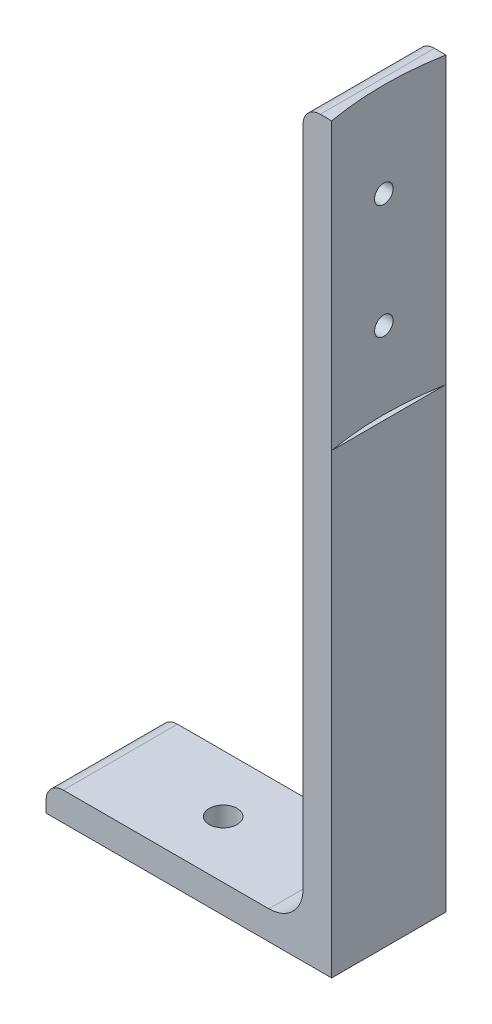
ISO-10303-21;
HEADER;
FILE_DESCRIPTION(('STEP AP214'),'2;1');
FILE_NAME('part.step','',(''),(''),'','','');
FILE_SCHEMA(('AUTOMOTIVE_DESIGN { 1 0 10303 214 1 1 1 1 }'));
ENDSEC;
DATA;
#1=APPLICATION_CONTEXT('core data for automotive mechanical design processes');
#2=APPLICATION_PROTOCOL_DEFINITION('international standard','automotive_design',2000,#1);
#3=PRODUCT_CONTEXT('',#1,'mechanical');
#4=PRODUCT('Part','Part','',(#3));
#5=PRODUCT_RELATED_PRODUCT_CATEGORY('part','',(#4));
#6=PRODUCT_DEFINITION_FORMATION('','',#4);
#7=PRODUCT_DEFINITION_CONTEXT('part definition',#1,'design');
#8=PRODUCT_DEFINITION('design','',#6,#7);
#9=PRODUCT_DEFINITION_SHAPE('','',#8);
#10=(LENGTH_UNIT() NAMED_UNIT(*) SI_UNIT(.MILLI.,.METRE.));
#11=(NAMED_UNIT(*) PLANE_ANGLE_UNIT() SI_UNIT($,.RADIAN.));
#12=(NAMED_UNIT(*) SI_UNIT($,.STERADIAN.) SOLID_ANGLE_UNIT());
#13=UNCERTAINTY_MEASURE_WITH_UNIT(LENGTH_MEASURE(1.E-05),#10,'distance_accuracy_value','');
#14=(GEOMETRIC_REPRESENTATION_CONTEXT(3) GLOBAL_UNCERTAINTY_ASSIGNED_CONTEXT((#13)) GLOBAL_UNIT_ASSIGNED_CONTEXT((#10,
#11,#12)) REPRESENTATION_CONTEXT('',''));
#15=CARTESIAN_POINT('',(0.,0.,0.));
#16=DIRECTION('',(0.,0.,1.));
#17=DIRECTION('',(1.,0.,0.));
#18=AXIS2_PLACEMENT_3D('',#15,#16,#17);
#19=CARTESIAN_POINT('',(0.,0.,10.));
#20=DIRECTION('',(-1.,0.,0.));
#21=DIRECTION('',(0.,0.,1.));
#22=AXIS2_PLACEMENT_3D('',#19,#20,#21);
#23=PLANE('',#22);
#24=DIRECTION('',(0.,0.,-1.));
#25=VECTOR('',#24,1.);
#26=CARTESIAN_POINT('',(0.,80.,0.));
#27=LINE('',#26,#25);
#28=CARTESIAN_POINT('',(0.,80.,10.));
#29=VERTEX_POINT('',#28);
#30=CARTESIAN_POINT('',(0.,80.,-10.));
#31=VERTEX_POINT('',#30);
#32=EDGE_CURVE('E277',#29,#31,#27,.T.);
#33=ORIENTED_EDGE('',*,*,#32,.F.);
#34=DIRECTION('',(0.,1.,0.));
#35=VECTOR('',#34,1.);
#36=CARTESIAN_POINT('',(0.,0.,10.));
#37=LINE('',#36,#35);
#38=CARTESIAN_POINT('',(0.,0.,10.));
#39=VERTEX_POINT('',#38);
#40=EDGE_CURVE('E151',#39,#29,#37,.T.);
#41=ORIENTED_EDGE('',*,*,#40,.F.);
#42=DIRECTION('',(0.,0.,-1.));
#43=VECTOR('',#42,1.);
#44=CARTESIAN_POINT('',(0.,0.,10.));
#45=LINE('',#44,#43);
#46=CARTESIAN_POINT('',(0.,0.,-10.));
#47=VERTEX_POINT('',#46);
#48=EDGE_CURVE('E146',#39,#47,#45,.T.);
#49=ORIENTED_EDGE('',*,*,#48,.T.);
#50=DIRECTION('',(0.,1.,0.));
#51=VECTOR('',#50,1.);
#52=CARTESIAN_POINT('',(0.,0.,-10.));
#53=LINE('',#52,#51);
#54=EDGE_CURVE('E173',#47,#31,#53,.T.);
#55=ORIENTED_EDGE('',*,*,#54,.T.);
#56=EDGE_LOOP('',(#33,#41,#49,#55));
#57=FACE_BOUND('',#56,.T.);
#58=ADVANCED_FACE('F36',(#57),#23,.F.);
#59=CARTESIAN_POINT('',(-2.,127.,10.));
#60=DIRECTION('',(0.,0.,-1.));
#61=DIRECTION('',(-1.,0.,0.));
#62=AXIS2_PLACEMENT_3D('',#59,#60,#61);
#63=CYLINDRICAL_SURFACE('',#62,3.);
#64=CARTESIAN_POINT('',(-2.,127.,-10.));
#65=DIRECTION('',(0.,0.,1.));
#66=DIRECTION('',(1.,0.,0.));
#67=AXIS2_PLACEMENT_3D('',#64,#65,#66);
#68=CIRCLE('',#67,3.);
#69=CARTESIAN_POINT('',(-2.,130.,-10.));
#70=VERTEX_POINT('',#69);
#71=CARTESIAN_POINT('',(-5.,127.,-10.));
#72=VERTEX_POINT('',#71);
#73=EDGE_CURVE('E158',#70,#72,#68,.T.);
#74=ORIENTED_EDGE('',*,*,#73,.T.);
#75=DIRECTION('',(0.,0.,-1.));
#76=VECTOR('',#75,1.);
#77=CARTESIAN_POINT('',(-5.,127.,10.));
#78=LINE('',#77,#76);
#79=CARTESIAN_POINT('',(-5.,127.,10.));
#80=VERTEX_POINT('',#79);
#81=EDGE_CURVE('E11',#80,#72,#78,.T.);
#82=ORIENTED_EDGE('',*,*,#81,.F.);
#83=CARTESIAN_POINT('',(-2.,127.,10.));
#84=DIRECTION('',(0.,0.,1.));
#85=DIRECTION('',(1.,0.,0.));
#86=AXIS2_PLACEMENT_3D('',#83,#84,#85);
#87=CIRCLE('',#86,3.);
#88=CARTESIAN_POINT('',(-2.,130.,10.));
#89=VERTEX_POINT('',#88);
#90=EDGE_CURVE('E177',#89,#80,#87,.T.);
#91=ORIENTED_EDGE('',*,*,#90,.F.);
#92=DIRECTION('',(0.,0.,-1.));
#93=VECTOR('',#92,1.);
#94=CARTESIAN_POINT('',(-2.,130.,10.));
#95=LINE('',#94,#93);
#96=EDGE_CURVE('E157',#89,#70,#95,.T.);
#97=ORIENTED_EDGE('',*,*,#96,.T.);
#98=EDGE_LOOP('',(#74,#82,#91,#97));
#99=FACE_BOUND('',#98,.T.);
#100=ADVANCED_FACE('F38',(#99),#63,.T.);
#101=CARTESIAN_POINT('',(-5.,127.,10.));
#102=DIRECTION('',(1.,0.,0.));
#103=DIRECTION('',(0.,1.,0.));
#104=AXIS2_PLACEMENT_3D('',#101,#102,#103);
#105=PLANE('',#104);
#106=CARTESIAN_POINT('',(-4.99999999999999,93.5,0.));
#107=DIRECTION('',(-1.,0.,0.));
#108=DIRECTION('',(0.,-1.,0.));
#109=AXIS2_PLACEMENT_3D('',#106,#107,#108);
#110=CIRCLE('',#109,1.625);
#111=CARTESIAN_POINT('',(-4.99999999999999,91.875,0.));
#112=VERTEX_POINT('',#111);
#113=EDGE_CURVE('E194',#112,#112,#110,.T.);
#114=ORIENTED_EDGE('',*,*,#113,.F.);
#115=EDGE_LOOP('',(#114));
#116=FACE_BOUND('',#115,.T.);
#117=CARTESIAN_POINT('',(-5.,113.5,0.));
#118=DIRECTION('',(-1.,0.,0.));
#119=DIRECTION('',(0.,-1.,0.));
#120=AXIS2_PLACEMENT_3D('',#117,#118,#119);
#121=CIRCLE('',#120,1.625);
#122=CARTESIAN_POINT('',(-5.,111.875,0.));
#123=VERTEX_POINT('',#122);
#124=EDGE_CURVE('E252',#123,#123,#121,.T.);
#125=ORIENTED_EDGE('',*,*,#124,.F.);
#126=EDGE_LOOP('',(#125));
#127=FACE_BOUND('',#126,.T.);
#128=DIRECTION('',(0.,-1.,0.));
#129=VECTOR('',#128,1.);
#130=CARTESIAN_POINT('',(-5.,127.,-10.));
#131=LINE('',#130,#129);
#132=CARTESIAN_POINT('',(-4.99999999999999,11.,-10.));
#133=VERTEX_POINT('',#132);
#134=EDGE_CURVE('E161',#72,#133,#131,.T.);
#135=ORIENTED_EDGE('',*,*,#134,.T.);
#136=DIRECTION('',(0.,0.,-1.));
#137=VECTOR('',#136,1.);
#138=CARTESIAN_POINT('',(-4.99999999999999,11.,10.));
#139=LINE('',#138,#137);
#140=CARTESIAN_POINT('',(-4.99999999999999,11.,10.));
#141=VERTEX_POINT('',#140);
#142=EDGE_CURVE('E50',#141,#133,#139,.T.);
#143=ORIENTED_EDGE('',*,*,#142,.F.);
#144=DIRECTION('',(0.,-1.,0.));
#145=VECTOR('',#144,1.);
#146=CARTESIAN_POINT('',(-5.,127.,10.));
#147=LINE('',#146,#145);
#148=EDGE_CURVE('E109',#80,#141,#147,.T.);
#149=ORIENTED_EDGE('',*,*,#148,.F.);
#150=ORIENTED_EDGE('',*,*,#81,.T.);
#151=EDGE_LOOP('',(#135,#143,#149,#150));
#152=FACE_BOUND('',#151,.T.);
#153=ADVANCED_FACE('F220',(#116,#127,#152),#105,.F.);
#154=CARTESIAN_POINT('',(-11.,11.,10.));
#155=DIRECTION('',(0.,0.,-1.));
#156=DIRECTION('',(-1.,0.,0.));
#157=AXIS2_PLACEMENT_3D('',#154,#155,#156);
#158=CYLINDRICAL_SURFACE('',#157,6.);
#159=CARTESIAN_POINT('',(-11.,11.,-10.));
#160=DIRECTION('',(0.,0.,-1.));
#161=DIRECTION('',(-1.,0.,0.));
#162=AXIS2_PLACEMENT_3D('',#159,#160,#161);
#163=CIRCLE('',#162,6.);
#164=CARTESIAN_POINT('',(-11.,5.,-10.));
#165=VERTEX_POINT('',#164);
#166=EDGE_CURVE('E164',#133,#165,#163,.T.);
#167=ORIENTED_EDGE('',*,*,#166,.T.);
#168=DIRECTION('',(0.,0.,-1.));
#169=VECTOR('',#168,1.);
#170=CARTESIAN_POINT('',(-11.,5.,10.));
#171=LINE('',#170,#169);
#172=CARTESIAN_POINT('',(-11.,5.,10.));
#173=VERTEX_POINT('',#172);
#174=EDGE_CURVE('E184',#173,#165,#171,.T.);
#175=ORIENTED_EDGE('',*,*,#174,.F.);
#176=CARTESIAN_POINT('',(-11.,11.,10.));
#177=DIRECTION('',(0.,0.,-1.));
#178=DIRECTION('',(-1.,0.,0.));
#179=AXIS2_PLACEMENT_3D('',#176,#177,#178);
#180=CIRCLE('',#179,6.);
#181=EDGE_CURVE('E259',#141,#173,#180,.T.);
#182=ORIENTED_EDGE('',*,*,#181,.F.);
#183=ORIENTED_EDGE('',*,*,#142,.T.);
#184=EDGE_LOOP('',(#167,#175,#182,#183));
#185=FACE_BOUND('',#184,.T.);
#186=ADVANCED_FACE('F239',(#185),#158,.F.);
#187=CARTESIAN_POINT('',(-11.,5.,10.));
#188=DIRECTION('',(0.,-1.,0.));
#189=DIRECTION('',(1.,0.,0.));
#190=AXIS2_PLACEMENT_3D('',#187,#188,#189);
#191=PLANE('',#190);
#192=CARTESIAN_POINT('',(-29.,5.,0.));
#193=DIRECTION('',(0.,1.,0.));
#194=DIRECTION('',(-1.,0.,0.));
#195=AXIS2_PLACEMENT_3D('',#192,#193,#194);
#196=CIRCLE('',#195,2.45);
#197=CARTESIAN_POINT('',(-31.45,5.,0.));
#198=VERTEX_POINT('',#197);
#199=EDGE_CURVE('E283',#198,#198,#196,.T.);
#200=ORIENTED_EDGE('',*,*,#199,.F.);
#201=EDGE_LOOP('',(#200));
#202=FACE_BOUND('',#201,.T.);
#203=DIRECTION('',(-1.,0.,0.));
#204=VECTOR('',#203,1.);
#205=CARTESIAN_POINT('',(-11.,5.,-10.));
#206=LINE('',#205,#204);
#207=CARTESIAN_POINT('',(-47.,5.,-10.));
#208=VERTEX_POINT('',#207);
#209=EDGE_CURVE('E166',#165,#208,#206,.T.);
#210=ORIENTED_EDGE('',*,*,#209,.T.);
#211=DIRECTION('',(0.,0.,-1.));
#212=VECTOR('',#211,1.);
#213=CARTESIAN_POINT('',(-47.,5.,10.));
#214=LINE('',#213,#212);
#215=CARTESIAN_POINT('',(-47.,5.,10.));
#216=VERTEX_POINT('',#215);
#217=EDGE_CURVE('E181',#216,#208,#214,.T.);
#218=ORIENTED_EDGE('',*,*,#217,.F.);
#219=DIRECTION('',(-1.,0.,0.));
#220=VECTOR('',#219,1.);
#221=CARTESIAN_POINT('',(-11.,5.,10.));
#222=LINE('',#221,#220);
#223=EDGE_CURVE('E265',#173,#216,#222,.T.);
#224=ORIENTED_EDGE('',*,*,#223,.F.);
#225=ORIENTED_EDGE('',*,*,#174,.T.);
#226=EDGE_LOOP('',(#210,#218,#224,#225));
#227=FACE_BOUND('',#226,.T.);
#228=ADVANCED_FACE('F235',(#202,#227),#191,.F.);
#229=CARTESIAN_POINT('',(-47.,1.99999999999999,10.));
#230=DIRECTION('',(0.,0.,-1.));
#231=DIRECTION('',(-1.,0.,0.));
#232=AXIS2_PLACEMENT_3D('',#229,#230,#231);
#233=CYLINDRICAL_SURFACE('',#232,3.);
#234=CARTESIAN_POINT('',(-47.,1.99999999999999,-10.));
#235=DIRECTION('',(0.,0.,1.));
#236=DIRECTION('',(1.,0.,0.));
#237=AXIS2_PLACEMENT_3D('',#234,#235,#236);
#238=CIRCLE('',#237,3.);
#239=CARTESIAN_POINT('',(-50.,1.99999999999999,-10.));
#240=VERTEX_POINT('',#239);
#241=EDGE_CURVE('E168',#208,#240,#238,.T.);
#242=ORIENTED_EDGE('',*,*,#241,.T.);
#243=DIRECTION('',(0.,0.,-1.));
#244=VECTOR('',#243,1.);
#245=CARTESIAN_POINT('',(-50.,1.99999999999999,10.));
#246=LINE('',#245,#244);
#247=CARTESIAN_POINT('',(-50.,1.99999999999999,10.));
#248=VERTEX_POINT('',#247);
#249=EDGE_CURVE('E145',#248,#240,#246,.T.);
#250=ORIENTED_EDGE('',*,*,#249,.F.);
#251=CARTESIAN_POINT('',(-47.,1.99999999999999,10.));
#252=DIRECTION('',(0.,0.,1.));
#253=DIRECTION('',(1.,0.,0.));
#254=AXIS2_PLACEMENT_3D('',#251,#252,#253);
#255=CIRCLE('',#254,3.);
#256=EDGE_CURVE('E133',#216,#248,#255,.T.);
#257=ORIENTED_EDGE('',*,*,#256,.F.);
#258=ORIENTED_EDGE('',*,*,#217,.T.);
#259=EDGE_LOOP('',(#242,#250,#257,#258));
#260=FACE_BOUND('',#259,.T.);
#261=ADVANCED_FACE('F232',(#260),#233,.T.);
#262=CARTESIAN_POINT('',(-50.,1.99999999999999,10.));
#263=DIRECTION('',(1.,0.,0.));
#264=DIRECTION('',(0.,0.,-1.));
#265=AXIS2_PLACEMENT_3D('',#262,#263,#264);
#266=PLANE('',#265);
#267=DIRECTION('',(0.,-1.,0.));
#268=VECTOR('',#267,1.);
#269=CARTESIAN_POINT('',(-50.,1.99999999999999,-10.));
#270=LINE('',#269,#268);
#271=CARTESIAN_POINT('',(-50.,0.,-10.));
#272=VERTEX_POINT('',#271);
#273=EDGE_CURVE('E142',#240,#272,#270,.T.);
#274=ORIENTED_EDGE('',*,*,#273,.T.);
#275=DIRECTION('',(0.,0.,-1.));
#276=VECTOR('',#275,1.);
#277=CARTESIAN_POINT('',(-50.,0.,10.));
#278=LINE('',#277,#276);
#279=CARTESIAN_POINT('',(-50.,0.,10.));
#280=VERTEX_POINT('',#279);
#281=EDGE_CURVE('E139',#280,#272,#278,.T.);
#282=ORIENTED_EDGE('',*,*,#281,.F.);
#283=DIRECTION('',(0.,-1.,0.));
#284=VECTOR('',#283,1.);
#285=CARTESIAN_POINT('',(-50.,1.99999999999999,10.));
#286=LINE('',#285,#284);
#287=EDGE_CURVE('E125',#248,#280,#286,.T.);
#288=ORIENTED_EDGE('',*,*,#287,.F.);
#289=ORIENTED_EDGE('',*,*,#249,.T.);
#290=EDGE_LOOP('',(#274,#282,#288,#289));
#291=FACE_BOUND('',#290,.T.);
#292=ADVANCED_FACE('F140',(#291),#266,.F.);
#293=CARTESIAN_POINT('',(0.,0.,10.));
#294=DIRECTION('',(0.,1.,0.));
#295=DIRECTION('',(-1.,0.,0.));
#296=AXIS2_PLACEMENT_3D('',#293,#294,#295);
#297=PLANE('',#296);
#298=CARTESIAN_POINT('',(-29.,0.,0.));
#299=DIRECTION('',(0.,1.,0.));
#300=DIRECTION('',(-1.,0.,0.));
#301=AXIS2_PLACEMENT_3D('',#298,#299,#300);
#302=CIRCLE('',#301,2.45);
#303=CARTESIAN_POINT('',(-31.45,0.,0.));
#304=VERTEX_POINT('',#303);
#305=EDGE_CURVE('E281',#304,#304,#302,.T.);
#306=ORIENTED_EDGE('',*,*,#305,.T.);
#307=EDGE_LOOP('',(#306));
#308=FACE_BOUND('',#307,.T.);
#309=DIRECTION('',(1.,0.,0.));
#310=VECTOR('',#309,1.);
#311=CARTESIAN_POINT('',(0.,0.,-10.));
#312=LINE('',#311,#310);
#313=EDGE_CURVE('E171',#272,#47,#312,.T.);
#314=ORIENTED_EDGE('',*,*,#313,.T.);
#315=ORIENTED_EDGE('',*,*,#48,.F.);
#316=DIRECTION('',(1.,0.,0.));
#317=VECTOR('',#316,1.);
#318=CARTESIAN_POINT('',(0.,0.,10.));
#319=LINE('',#318,#317);
#320=EDGE_CURVE('E130',#280,#39,#319,.T.);
#321=ORIENTED_EDGE('',*,*,#320,.F.);
#322=ORIENTED_EDGE('',*,*,#281,.T.);
#323=EDGE_LOOP('',(#314,#315,#321,#322));
#324=FACE_BOUND('',#323,.T.);
#325=ADVANCED_FACE('F148',(#308,#324),#297,.F.);
#326=CARTESIAN_POINT('',(-2.,130.,10.));
#327=DIRECTION('',(0.,-1.,0.));
#328=DIRECTION('',(0.,0.,-1.));
#329=AXIS2_PLACEMENT_3D('',#326,#327,#328);
#330=PLANE('',#329);
#331=DIRECTION('',(-1.,0.,0.));
#332=VECTOR('',#331,1.);
#333=CARTESIAN_POINT('',(-2.,130.,10.));
#334=LINE('',#333,#332);
#335=CARTESIAN_POINT('',(0.,130.,10.));
#336=VERTEX_POINT('',#335);
#337=EDGE_CURVE('E67',#336,#89,#334,.T.);
#338=ORIENTED_EDGE('',*,*,#337,.F.);
#339=CARTESIAN_POINT('',(56.1159513863928,130.,0.));
#340=DIRECTION('',(0.,1.,0.));
#341=DIRECTION('',(0.,0.,1.));
#342=AXIS2_PLACEMENT_3D('',#339,#340,#341);
#343=CIRCLE('',#342,57.);
#344=CARTESIAN_POINT('',(0.,130.,-10.));
#345=VERTEX_POINT('',#344);
#346=EDGE_CURVE('E274',#345,#336,#343,.T.);
#347=ORIENTED_EDGE('',*,*,#346,.F.);
#348=DIRECTION('',(-1.,0.,0.));
#349=VECTOR('',#348,1.);
#350=CARTESIAN_POINT('',(-2.,130.,-10.));
#351=LINE('',#350,#349);
#352=EDGE_CURVE('E101',#345,#70,#351,.T.);
#353=ORIENTED_EDGE('',*,*,#352,.T.);
#354=ORIENTED_EDGE('',*,*,#96,.F.);
#355=EDGE_LOOP('',(#338,#347,#353,#354));
#356=FACE_BOUND('',#355,.T.);
#357=ADVANCED_FACE('F225',(#356),#330,.F.);
#358=CARTESIAN_POINT('',(-2.,127.,10.));
#359=DIRECTION('',(0.,0.,1.));
#360=DIRECTION('',(1.,0.,0.));
#361=AXIS2_PLACEMENT_3D('',#358,#359,#360);
#362=PLANE('',#361);
#363=ORIENTED_EDGE('',*,*,#90,.T.);
#364=ORIENTED_EDGE('',*,*,#148,.T.);
#365=ORIENTED_EDGE('',*,*,#181,.T.);
#366=ORIENTED_EDGE('',*,*,#223,.T.);
#367=ORIENTED_EDGE('',*,*,#256,.T.);
#368=ORIENTED_EDGE('',*,*,#287,.T.);
#369=ORIENTED_EDGE('',*,*,#320,.T.);
#370=ORIENTED_EDGE('',*,*,#40,.T.);
#371=DIRECTION('',(0.,1.,0.));
#372=VECTOR('',#371,1.);
#373=CARTESIAN_POINT('',(0.,80.,10.));
#374=LINE('',#373,#372);
#375=EDGE_CURVE('E162',#29,#336,#374,.T.);
#376=ORIENTED_EDGE('',*,*,#375,.T.);
#377=ORIENTED_EDGE('',*,*,#337,.T.);
#378=EDGE_LOOP('',(#363,#364,#365,#366,#367,#368,#369,#370,#376,#377));
#379=FACE_BOUND('',#378,.T.);
#380=ADVANCED_FACE('F127',(#379),#362,.T.);
#381=CARTESIAN_POINT('',(-2.,127.,-10.));
#382=DIRECTION('',(0.,0.,1.));
#383=DIRECTION('',(1.,0.,0.));
#384=AXIS2_PLACEMENT_3D('',#381,#382,#383);
#385=PLANE('',#384);
#386=ORIENTED_EDGE('',*,*,#73,.F.);
#387=ORIENTED_EDGE('',*,*,#352,.F.);
#388=DIRECTION('',(0.,1.,0.));
#389=VECTOR('',#388,1.);
#390=CARTESIAN_POINT('',(0.,80.,-10.));
#391=LINE('',#390,#389);
#392=EDGE_CURVE('E271',#31,#345,#391,.T.);
#393=ORIENTED_EDGE('',*,*,#392,.F.);
#394=ORIENTED_EDGE('',*,*,#54,.F.);
#395=ORIENTED_EDGE('',*,*,#313,.F.);
#396=ORIENTED_EDGE('',*,*,#273,.F.);
#397=ORIENTED_EDGE('',*,*,#241,.F.);
#398=ORIENTED_EDGE('',*,*,#209,.F.);
#399=ORIENTED_EDGE('',*,*,#166,.F.);
#400=ORIENTED_EDGE('',*,*,#134,.F.);
#401=EDGE_LOOP('',(#386,#387,#393,#394,#395,#396,#397,#398,#399,#400));
#402=FACE_BOUND('',#401,.T.);
#403=ADVANCED_FACE('F212',(#402),#385,.F.);
#404=CARTESIAN_POINT('',(56.1159513863928,80.,0.));
#405=DIRECTION('',(0.,1.,0.));
#406=DIRECTION('',(0.,0.,1.));
#407=AXIS2_PLACEMENT_3D('',#404,#405,#406);
#408=CYLINDRICAL_SURFACE('',#407,57.);
#409=CARTESIAN_POINT('',(-0.884048613607205,91.875,0.));
#410=CARTESIAN_POINT('',(-0.884048301419244,91.8750040407851,0.0912570705500619));
#411=CARTESIAN_POINT('',(-0.883827108364941,91.8827130510623,0.182579839011391));
#412=CARTESIAN_POINT('',(-0.882965989506306,91.9133580817059,0.362708935005013));
#413=CARTESIAN_POINT('',(-0.88232556316476,91.93631230434,0.451512121922383));
#414=CARTESIAN_POINT('',(-0.880698506544359,91.9967925506374,0.623966457629173));
#415=CARTESIAN_POINT('',(-0.879712045260624,92.03431146221,0.707620097932997));
#416=CARTESIAN_POINT('',(-0.877504198818861,92.122845903173,0.867418236400548));
#417=CARTESIAN_POINT('',(-0.876282871132212,92.1738581319176,0.943564564708674));
#418=CARTESIAN_POINT('',(-0.873742237223969,92.2879567890859,1.08624244717693));
#419=CARTESIAN_POINT('',(-0.872422896051672,92.3510475373679,1.15277054640994));
#420=CARTESIAN_POINT('',(-0.869835242310035,92.487504940964,1.27429447354724));
#421=CARTESIAN_POINT('',(-0.868566931771846,92.5608720047822,1.32928984278529));
#422=CARTESIAN_POINT('',(-0.866224200511634,92.7158115271648,1.42619202997452));
#423=CARTESIAN_POINT('',(-0.865149809253497,92.7973852297096,1.46809685966885));
#424=CARTESIAN_POINT('',(-0.863316377658713,92.9664135646253,1.53761546507425));
#425=CARTESIAN_POINT('',(-0.862557336118333,93.0538681745465,1.56522929533611));
#426=CARTESIAN_POINT('',(-0.861440437415242,93.2321505052766,1.60537485451699));
#427=CARTESIAN_POINT('',(-0.861082470564122,93.3229772968164,1.61791070712445));
#428=CARTESIAN_POINT('',(-0.860807753271562,93.5054467623545,1.62755716307993));
#429=CARTESIAN_POINT('',(-0.860891001162523,93.5970894332678,1.62466782472849));
#430=CARTESIAN_POINT('',(-0.861489223482446,93.7785612792106,1.60354941438371));
#431=CARTESIAN_POINT('',(-0.86200407236305,93.8683909738356,1.5853248032602));
#432=CARTESIAN_POINT('',(-0.86340725970101,94.0437153684787,1.53406007525515));
#433=CARTESIAN_POINT('',(-0.864295598939145,94.1292100594341,1.50101992740184));
#434=CARTESIAN_POINT('',(-0.866345768980347,94.2934518908058,1.42105689833791));
#435=CARTESIAN_POINT('',(-0.867507640064752,94.3721980350735,1.37413197214041));
#436=CARTESIAN_POINT('',(-0.869973852324642,94.5206965142471,1.26773294211103));
#437=CARTESIAN_POINT('',(-0.871278193788508,94.5904488309476,1.20825881287757));
#438=CARTESIAN_POINT('',(-0.873882866099718,94.7190056338839,1.07842439122159));
#439=CARTESIAN_POINT('',(-0.875183195353381,94.7778062125266,1.0080602295557));
#440=CARTESIAN_POINT('',(-0.877632806960904,94.8827603125688,0.858456784977403));
#441=CARTESIAN_POINT('',(-0.878782089290813,94.9289138319628,0.779217500657651));
#442=CARTESIAN_POINT('',(-0.880800064456523,95.0072632328819,0.614110976005348));
#443=CARTESIAN_POINT('',(-0.88166875483895,95.0394589923672,0.528243677728453));
#444=CARTESIAN_POINT('',(-0.883027581099235,95.0889764559222,0.352319577175232));
#445=CARTESIAN_POINT('',(-0.883517717909278,95.106298196619,0.262262785216087));
#446=CARTESIAN_POINT('',(-0.884064066741103,95.1255711323636,0.0805500520662809));
#447=CARTESIAN_POINT('',(-0.884120431395588,95.1275277339938,-0.011105315249858));
#448=CARTESIAN_POINT('',(-0.883793286413652,95.1160289387422,-0.193443238277225));
#449=CARTESIAN_POINT('',(-0.88340977723559,95.1025735579202,-0.284125795002048));
#450=CARTESIAN_POINT('',(-0.882246206498614,95.0606372234982,-0.461928862868564));
#451=CARTESIAN_POINT('',(-0.881466209705213,95.0321587238681,-0.549049953258776));
#452=CARTESIAN_POINT('',(-0.879597562012541,94.9609870484448,-0.717274801962333));
#453=CARTESIAN_POINT('',(-0.878508910557204,94.9182938470427,-0.798378549434595));
#454=CARTESIAN_POINT('',(-0.876145221034166,94.8198907540791,-0.952291348299664));
#455=CARTESIAN_POINT('',(-0.874870130894296,94.7641772233409,-1.02509807219871));
#456=CARTESIAN_POINT('',(-0.872277445287141,94.641320323247,-1.16032672709317));
#457=CARTESIAN_POINT('',(-0.870959849720132,94.5741769270734,-1.22274863372209));
#458=CARTESIAN_POINT('',(-0.868430256585682,94.4303430968685,-1.33545375746673));
#459=CARTESIAN_POINT('',(-0.867218289431239,94.3536499285608,-1.38573348588391));
#460=CARTESIAN_POINT('',(-0.86503707585264,94.192907574147,-1.47270313066339));
#461=CARTESIAN_POINT('',(-0.864067828909792,94.1088584037612,-1.50939307606707));
#462=CARTESIAN_POINT('',(-0.862481553163349,93.9358030405942,-1.56813555367483));
#463=CARTESIAN_POINT('',(-0.861864469987987,93.8467976153563,-1.59019034553585));
#464=CARTESIAN_POINT('',(-0.861051943400036,93.6663453866337,-1.61904387145562));
#465=CARTESIAN_POINT('',(-0.860856499726194,93.5748985846618,-1.62584261496715));
#466=CARTESIAN_POINT('',(-0.860909307618281,93.3921944102099,-1.62399078538627));
#467=CARTESIAN_POINT('',(-0.861157401076712,93.3009369818332,-1.61534571754374));
#468=CARTESIAN_POINT('',(-0.862068982868488,93.1211693287558,-1.58286298167196));
#469=CARTESIAN_POINT('',(-0.86273247202662,93.0326591095103,-1.55902528347704));
#470=CARTESIAN_POINT('',(-0.864400026919312,92.860896104712,-1.49683465049082));
#471=CARTESIAN_POINT('',(-0.8654040984413,92.7776434085275,-1.45848146904038));
#472=CARTESIAN_POINT('',(-0.867639582750199,92.6187605565862,-1.36835063720778));
#473=CARTESIAN_POINT('',(-0.868870987247036,92.5431301230264,-1.31657347632544));
#474=CARTESIAN_POINT('',(-0.871422751668813,92.4016137598144,-1.20104887295966));
#475=CARTESIAN_POINT('',(-0.872743133750872,92.3357302704864,-1.13729844178749));
#476=CARTESIAN_POINT('',(-0.875324115852912,92.2155830795976,-0.999623103418122));
#477=CARTESIAN_POINT('',(-0.876584700983665,92.1613222603392,-0.925695679881101));
#478=CARTESIAN_POINT('',(-0.87890440020436,92.065952322061,-0.769737529256052));
#479=CARTESIAN_POINT('',(-0.87996338654307,92.024851531252,-0.687701713642046));
#480=CARTESIAN_POINT('',(-0.881758194250723,91.9570541651337,-0.517954459568831));
#481=CARTESIAN_POINT('',(-0.882494400987531,91.9303404043373,-0.43024993341061));
#482=CARTESIAN_POINT('',(-0.883363822236891,91.8991587086527,-0.284992427938202));
#483=CARTESIAN_POINT('',(-0.883619505545784,91.8901105832309,-0.228382386363382));
#484=CARTESIAN_POINT('',(-0.883961999176128,91.8780299616655,-0.114523522680112));
#485=CARTESIAN_POINT('',(-0.884048809542402,91.8749974639252,-0.0572747007412097));
#486=CARTESIAN_POINT('',(-0.884048613607205,91.875,0.));
#487=B_SPLINE_CURVE_WITH_KNOTS('',3,(#409,#410,#411,#412,#413,#414,#415,#416,#417,#418,#419,
#420,#421,#422,#423,#424,#425,#426,#427,#428,#429,#430,#431,#432,#433,#434,#435,#436,#437,#438,
#439,#440,#441,#442,#443,#444,#445,#446,#447,#448,#449,#450,#451,#452,#453,#454,#455,#456,#457,
#458,#459,#460,#461,#462,#463,#464,#465,#466,#467,#468,#469,#470,#471,#472,#473,#474,#475,#476,
#477,#478,#479,#480,#481,#482,#483,#484,#485,#486),.UNSPECIFIED.,.T.,.F.,(4,2,2,2,2,2,2,2,2,2,2,
2,2,2,2,2,2,2,2,2,2,2,2,2,2,2,2,2,2,2,2,2,2,2,2,2,2,2,4),(0.,0.273562152282933,
0.547451517110849,0.821207306778998,1.09489619394832,1.36868314888286,1.64248099048765,
1.91632039768628,2.19015875959288,2.46392221218056,2.73768463006179,3.01136744084857,
3.28505082376988,3.5587745355846,3.83249880146477,4.10632054616977,4.38014233429538,
4.65396651653501,4.92779002448199,5.20151717692569,5.47524404413869,5.74892621294011,
6.02260887480617,6.29636812254301,6.5701280126078,6.8439664662073,7.11780433461021,
7.39159991280411,7.6653953213518,7.93909314962329,8.21279152133629,8.48649454416818,
8.76018758793712,9.03394904017396,9.30777830402759,9.58178051743494,9.85545470172064,
10.0271476398165,10.1988405323419),.UNSPECIFIED.);
#488=CARTESIAN_POINT('',(-0.884048613607205,91.875,0.));
#489=VERTEX_POINT('',#488);
#490=EDGE_CURVE('E40',#489,#489,#487,.T.);
#491=ORIENTED_EDGE('',*,*,#490,.T.);
#492=EDGE_LOOP('',(#491));
#493=FACE_BOUND('',#492,.T.);
#494=CARTESIAN_POINT('',(-0.884048613607205,111.875,0.));
#495=CARTESIAN_POINT('',(-0.884048301419244,111.875004040785,0.0912570705500619));
#496=CARTESIAN_POINT('',(-0.883827108364941,111.882713051062,0.182579839011391));
#497=CARTESIAN_POINT('',(-0.882965989506306,111.913358081706,0.362708935005013));
#498=CARTESIAN_POINT('',(-0.88232556316476,111.93631230434,0.451512121922383));
#499=CARTESIAN_POINT('',(-0.880698506544359,111.996792550637,0.623966457629173));
#500=CARTESIAN_POINT('',(-0.879712045260624,112.03431146221,0.707620097932997));
#501=CARTESIAN_POINT('',(-0.877504198818861,112.122845903173,0.867418236400548));
#502=CARTESIAN_POINT('',(-0.876282871132212,112.173858131918,0.943564564708674));
#503=CARTESIAN_POINT('',(-0.873742237223969,112.287956789086,1.08624244717693));
#504=CARTESIAN_POINT('',(-0.872422896051672,112.351047537368,1.15277054640994));
#505=CARTESIAN_POINT('',(-0.869835242310035,112.487504940964,1.27429447354724));
#506=CARTESIAN_POINT('',(-0.868566931771846,112.560872004782,1.32928984278529));
#507=CARTESIAN_POINT('',(-0.866224200511634,112.715811527165,1.42619202997451));
#508=CARTESIAN_POINT('',(-0.865149809253497,112.79738522971,1.46809685966885));
#509=CARTESIAN_POINT('',(-0.863316377658713,112.966413564625,1.53761546507425));
#510=CARTESIAN_POINT('',(-0.862557336118333,113.053868174546,1.56522929533611));
#511=CARTESIAN_POINT('',(-0.861440437415242,113.232150505277,1.60537485451699));
#512=CARTESIAN_POINT('',(-0.861082470564122,113.322977296816,1.61791070712445));
#513=CARTESIAN_POINT('',(-0.860807753271562,113.505446762355,1.62755716307993));
#514=CARTESIAN_POINT('',(-0.860891001162523,113.597089433268,1.62466782472849));
#515=CARTESIAN_POINT('',(-0.861489223482446,113.778561279211,1.60354941438371));
#516=CARTESIAN_POINT('',(-0.86200407236305,113.868390973836,1.5853248032602));
#517=CARTESIAN_POINT('',(-0.86340725970101,114.043715368479,1.53406007525515));
#518=CARTESIAN_POINT('',(-0.864295598939145,114.129210059434,1.50101992740184));
#519=CARTESIAN_POINT('',(-0.866345768980347,114.293451890806,1.42105689833791));
#520=CARTESIAN_POINT('',(-0.867507640064752,114.372198035073,1.37413197214041));
#521=CARTESIAN_POINT('',(-0.869973852324642,114.520696514247,1.26773294211103));
#522=CARTESIAN_POINT('',(-0.871278193788508,114.590448830948,1.20825881287757));
#523=CARTESIAN_POINT('',(-0.873882866099718,114.719005633884,1.07842439122159));
#524=CARTESIAN_POINT('',(-0.875183195353381,114.777806212527,1.0080602295557));
#525=CARTESIAN_POINT('',(-0.877632806960904,114.882760312569,0.858456784977403));
#526=CARTESIAN_POINT('',(-0.878782089290813,114.928913831963,0.779217500657651));
#527=CARTESIAN_POINT('',(-0.880800064456523,115.007263232882,0.614110976005348));
#528=CARTESIAN_POINT('',(-0.88166875483895,115.039458992367,0.528243677728453));
#529=CARTESIAN_POINT('',(-0.883027581099235,115.088976455922,0.352319577175232));
#530=CARTESIAN_POINT('',(-0.883517717909278,115.106298196619,0.262262785216087));
#531=CARTESIAN_POINT('',(-0.884064066741103,115.125571132364,0.0805500520662812));
#532=CARTESIAN_POINT('',(-0.884120431395588,115.127527733994,-0.0111053152498574));
#533=CARTESIAN_POINT('',(-0.883793286413652,115.116028938742,-0.193443238277224));
#534=CARTESIAN_POINT('',(-0.88340977723559,115.10257355792,-0.284125795002047));
#535=CARTESIAN_POINT('',(-0.882246206498614,115.060637223498,-0.461928862868564));
#536=CARTESIAN_POINT('',(-0.881466209705213,115.032158723868,-0.549049953258776));
#537=CARTESIAN_POINT('',(-0.879597562012541,114.960987048445,-0.717274801962333));
#538=CARTESIAN_POINT('',(-0.878508910557204,114.918293847043,-0.798378549434595));
#539=CARTESIAN_POINT('',(-0.876145221034166,114.819890754079,-0.952291348299664));
#540=CARTESIAN_POINT('',(-0.874870130894296,114.764177223341,-1.02509807219871));
#541=CARTESIAN_POINT('',(-0.872277445287141,114.641320323247,-1.16032672709317));
#542=CARTESIAN_POINT('',(-0.870959849720132,114.574176927073,-1.22274863372209));
#543=CARTESIAN_POINT('',(-0.868430256585682,114.430343096869,-1.33545375746673));
#544=CARTESIAN_POINT('',(-0.867218289431239,114.353649928561,-1.38573348588392));
#545=CARTESIAN_POINT('',(-0.86503707585264,114.192907574147,-1.47270313066339));
#546=CARTESIAN_POINT('',(-0.864067828909792,114.108858403761,-1.50939307606707));
#547=CARTESIAN_POINT('',(-0.862481553163349,113.935803040594,-1.56813555367483));
#548=CARTESIAN_POINT('',(-0.861864469987987,113.846797615356,-1.59019034553585));
#549=CARTESIAN_POINT('',(-0.861051943400036,113.666345386634,-1.61904387145562));
#550=CARTESIAN_POINT('',(-0.860856499726194,113.574898584662,-1.62584261496715));
#551=CARTESIAN_POINT('',(-0.860909307618281,113.39219441021,-1.62399078538627));
#552=CARTESIAN_POINT('',(-0.861157401076712,113.300936981833,-1.61534571754374));
#553=CARTESIAN_POINT('',(-0.862068982868488,113.121169328756,-1.58286298167196));
#554=CARTESIAN_POINT('',(-0.86273247202662,113.03265910951,-1.55902528347704));
#555=CARTESIAN_POINT('',(-0.864400026919312,112.860896104712,-1.49683465049082));
#556=CARTESIAN_POINT('',(-0.8654040984413,112.777643408527,-1.45848146904038));
#557=CARTESIAN_POINT('',(-0.867639582750199,112.618760556586,-1.36835063720778));
#558=CARTESIAN_POINT('',(-0.868870987247036,112.543130123026,-1.31657347632544));
#559=CARTESIAN_POINT('',(-0.871422751668813,112.401613759814,-1.20104887295966));
#560=CARTESIAN_POINT('',(-0.872743133750872,112.335730270486,-1.13729844178749));
#561=CARTESIAN_POINT('',(-0.875324115852912,112.215583079598,-0.999623103418122));
#562=CARTESIAN_POINT('',(-0.876584700983665,112.161322260339,-0.925695679881101));
#563=CARTESIAN_POINT('',(-0.87890440020436,112.065952322061,-0.769737529256052));
#564=CARTESIAN_POINT('',(-0.87996338654307,112.024851531252,-0.687701713642046));
#565=CARTESIAN_POINT('',(-0.881758194250723,111.957054165134,-0.517954459568831));
#566=CARTESIAN_POINT('',(-0.882494400987531,111.930340404337,-0.43024993341061));
#567=CARTESIAN_POINT('',(-0.883363822236891,111.899158708653,-0.284992427938202));
#568=CARTESIAN_POINT('',(-0.883619505545784,111.890110583231,-0.228382386363382));
#569=CARTESIAN_POINT('',(-0.883961999176128,111.878029961665,-0.114523522680112));
#570=CARTESIAN_POINT('',(-0.884048809542402,111.874997463925,-0.0572747007412097));
#571=CARTESIAN_POINT('',(-0.884048613607205,111.875,0.));
#572=B_SPLINE_CURVE_WITH_KNOTS('',3,(#494,#495,#496,#497,#498,#499,#500,#501,#502,#503,#504,
#505,#506,#507,#508,#509,#510,#511,#512,#513,#514,#515,#516,#517,#518,#519,#520,#521,#522,#523,
#524,#525,#526,#527,#528,#529,#530,#531,#532,#533,#534,#535,#536,#537,#538,#539,#540,#541,#542,
#543,#544,#545,#546,#547,#548,#549,#550,#551,#552,#553,#554,#555,#556,#557,#558,#559,#560,#561,
#562,#563,#564,#565,#566,#567,#568,#569,#570,#571),.UNSPECIFIED.,.T.,.F.,(4,2,2,2,2,2,2,2,2,2,2,
2,2,2,2,2,2,2,2,2,2,2,2,2,2,2,2,2,2,2,2,2,2,2,2,2,2,2,4),(0.,0.273562152282933,
0.547451517110849,0.821207306778998,1.09489619394832,1.36868314888286,1.64248099048765,
1.91632039768628,2.19015875959288,2.46392221218056,2.73768463006179,3.01136744084857,
3.28505082376988,3.5587745355846,3.83249880146476,4.10632054616977,4.38014233429538,
4.65396651653501,4.92779002448199,5.20151717692569,5.47524404413869,5.74892621294011,
6.02260887480617,6.29636812254301,6.57012801260779,6.84396646620731,7.11780433461021,
7.39159991280411,7.6653953213518,7.93909314962329,8.21279152133629,8.48649454416818,
8.76018758793712,9.03394904017396,9.30777830402759,9.58178051743494,9.85545470172064,
10.0271476398165,10.1988405323419),.UNSPECIFIED.);
#573=CARTESIAN_POINT('',(-0.884048613607205,111.875,0.));
#574=VERTEX_POINT('',#573);
#575=EDGE_CURVE('E188',#574,#574,#572,.T.);
#576=ORIENTED_EDGE('',*,*,#575,.T.);
#577=EDGE_LOOP('',(#576));
#578=FACE_BOUND('',#577,.T.);
#579=ORIENTED_EDGE('',*,*,#346,.T.);
#580=ORIENTED_EDGE('',*,*,#375,.F.);
#581=CARTESIAN_POINT('',(56.1159513863928,80.,0.));
#582=DIRECTION('',(0.,1.,0.));
#583=DIRECTION('',(0.,0.,1.));
#584=AXIS2_PLACEMENT_3D('',#581,#582,#583);
#585=CIRCLE('',#584,57.);
#586=EDGE_CURVE('E58',#31,#29,#585,.T.);
#587=ORIENTED_EDGE('',*,*,#586,.F.);
#588=ORIENTED_EDGE('',*,*,#392,.T.);
#589=EDGE_LOOP('',(#579,#580,#587,#588));
#590=FACE_BOUND('',#589,.T.);
#591=ADVANCED_FACE('F195',(#493,#578,#590),#408,.F.);
#592=CARTESIAN_POINT('',(0.,80.,0.));
#593=DIRECTION('',(0.,1.,0.));
#594=DIRECTION('',(0.,0.,1.));
#595=AXIS2_PLACEMENT_3D('',#592,#593,#594);
#596=PLANE('',#595);
#597=ORIENTED_EDGE('',*,*,#32,.T.);
#598=ORIENTED_EDGE('',*,*,#586,.T.);
#599=EDGE_LOOP('',(#597,#598));
#600=FACE_BOUND('',#599,.T.);
#601=ADVANCED_FACE('F203',(#600),#596,.T.);
#602=CARTESIAN_POINT('',(0.,113.5,0.));
#603=DIRECTION('',(-1.,0.,0.));
#604=DIRECTION('',(0.,-1.,0.));
#605=AXIS2_PLACEMENT_3D('',#602,#603,#604);
#606=CYLINDRICAL_SURFACE('',#605,1.625);
#607=ORIENTED_EDGE('',*,*,#124,.T.);
#608=EDGE_LOOP('',(#607));
#609=FACE_BOUND('',#608,.T.);
#610=ORIENTED_EDGE('',*,*,#575,.F.);
#611=EDGE_LOOP('',(#610));
#612=FACE_BOUND('',#611,.T.);
#613=ADVANCED_FACE('F199',(#609,#612),#606,.F.);
#614=CARTESIAN_POINT('',(0.,93.5,0.));
#615=DIRECTION('',(-1.,0.,0.));
#616=DIRECTION('',(0.,-1.,0.));
#617=AXIS2_PLACEMENT_3D('',#614,#615,#616);
#618=CYLINDRICAL_SURFACE('',#617,1.625);
#619=ORIENTED_EDGE('',*,*,#113,.T.);
#620=EDGE_LOOP('',(#619));
#621=FACE_BOUND('',#620,.T.);
#622=ORIENTED_EDGE('',*,*,#490,.F.);
#623=EDGE_LOOP('',(#622));
#624=FACE_BOUND('',#623,.T.);
#625=ADVANCED_FACE('F202',(#621,#624),#618,.F.);
#626=CARTESIAN_POINT('',(-29.,0.,0.));
#627=DIRECTION('',(0.,1.,0.));
#628=DIRECTION('',(-1.,0.,0.));
#629=AXIS2_PLACEMENT_3D('',#626,#627,#628);
#630=CYLINDRICAL_SURFACE('',#629,2.45);
#631=ORIENTED_EDGE('',*,*,#305,.F.);
#632=EDGE_LOOP('',(#631));
#633=FACE_BOUND('',#632,.T.);
#634=ORIENTED_EDGE('',*,*,#199,.T.);
#635=EDGE_LOOP('',(#634));
#636=FACE_BOUND('',#635,.T.);
#637=ADVANCED_FACE('F289',(#633,#636),#630,.F.);
#638=CLOSED_SHELL('',(#58,#100,#153,#186,#228,#261,#292,#325,#357,#380,#403,#591,#601,#613,#625,#637));
#639=MANIFOLD_SOLID_BREP('B2',#638);
#640=ADVANCED_BREP_SHAPE_REPRESENTATION('',(#18,#639),#14);
#641=SHAPE_DEFINITION_REPRESENTATION(#9,#640);
ENDSEC;
END-ISO-10303-21;
